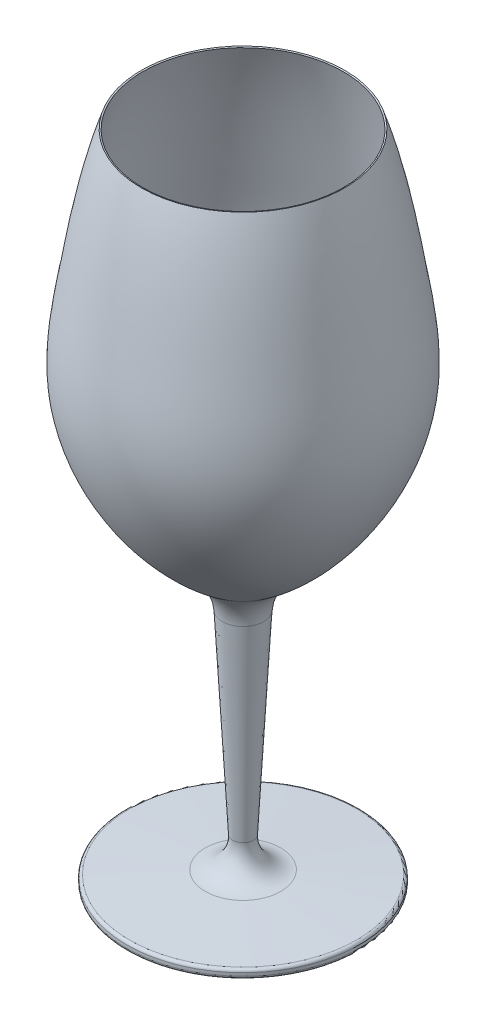
ISO-10303-21;
HEADER;
FILE_DESCRIPTION(('STEP AP214'),'2;1');
FILE_NAME('part.step','',(''),(''),'','','');
FILE_SCHEMA(('AUTOMOTIVE_DESIGN { 1 0 10303 214 1 1 1 1 }'));
ENDSEC;
DATA;
#1=APPLICATION_CONTEXT('core data for automotive mechanical design processes');
#2=APPLICATION_PROTOCOL_DEFINITION('international standard','automotive_design',2000,#1);
#3=PRODUCT_CONTEXT('',#1,'mechanical');
#4=PRODUCT('Part','Part','',(#3));
#5=PRODUCT_RELATED_PRODUCT_CATEGORY('part','',(#4));
#6=PRODUCT_DEFINITION_FORMATION('','',#4);
#7=PRODUCT_DEFINITION_CONTEXT('part definition',#1,'design');
#8=PRODUCT_DEFINITION('design','',#6,#7);
#9=PRODUCT_DEFINITION_SHAPE('','',#8);
#10=(LENGTH_UNIT() NAMED_UNIT(*) SI_UNIT(.MILLI.,.METRE.));
#11=(NAMED_UNIT(*) PLANE_ANGLE_UNIT() SI_UNIT($,.RADIAN.));
#12=(NAMED_UNIT(*) SI_UNIT($,.STERADIAN.) SOLID_ANGLE_UNIT());
#13=UNCERTAINTY_MEASURE_WITH_UNIT(LENGTH_MEASURE(1.E-05),#10,'distance_accuracy_value','');
#14=(GEOMETRIC_REPRESENTATION_CONTEXT(3) GLOBAL_UNCERTAINTY_ASSIGNED_CONTEXT((#13)) GLOBAL_UNIT_ASSIGNED_CONTEXT((#10,
#11,#12)) REPRESENTATION_CONTEXT('',''));
#15=CARTESIAN_POINT('',(0.,0.,0.));
#16=DIRECTION('',(0.,0.,1.));
#17=DIRECTION('',(1.,0.,0.));
#18=AXIS2_PLACEMENT_3D('',#15,#16,#17);
#19=CARTESIAN_POINT('',(7.5,90.5,0.));
#20=DIRECTION('',(0.,-1.,0.));
#21=DIRECTION('',(0.,0.,-1.));
#22=AXIS2_PLACEMENT_3D('',#19,#20,#21);
#23=PLANE('',#22);
#24=CARTESIAN_POINT('',(0.,90.5,0.));
#25=DIRECTION('',(0.,1.,0.));
#26=DIRECTION('',(0.,0.,1.));
#27=AXIS2_PLACEMENT_3D('',#24,#25,#26);
#28=CIRCLE('',#27,7.36580755563536);
#29=CARTESIAN_POINT('',(0.,90.5,7.36580755563536));
#30=VERTEX_POINT('',#29);
#31=EDGE_CURVE('E83',#30,#30,#28,.T.);
#32=ORIENTED_EDGE('',*,*,#31,.T.);
#33=EDGE_LOOP('',(#32));
#34=FACE_BOUND('',#33,.T.);
#35=ADVANCED_FACE('F37',(#34),#23,.F.);
#36=CARTESIAN_POINT('',(35.,225.,0.));
#37=CARTESIAN_POINT('',(39.9170201792758,210.365056176156,0.));
#38=CARTESIAN_POINT('',(44.1056743266489,185.466353245277,0.));
#39=CARTESIAN_POINT('',(52.4361400505516,135.138835851977,0.));
#40=CARTESIAN_POINT('',(28.2814009491732,101.995192324676,0.));
#41=CARTESIAN_POINT('',(7.49999999999999,90.,0.));
#42=B_SPLINE_CURVE_WITH_KNOTS('',3,(#36,#37,#38,#39,#40,#41),.UNSPECIFIED.,.F.,.F.,(4,1,1,4),
(0.,0.30696974385016,0.507280242844437,1.),.UNSPECIFIED.);
#43=CARTESIAN_POINT('',(0.,231.75,0.));
#44=DIRECTION('',(0.,1.,0.));
#45=AXIS1_PLACEMENT('',#43,#44);
#46=SURFACE_OF_REVOLUTION('',#42,#45);
#47=CARTESIAN_POINT('',(0.,94.0246612386085,0.));
#48=DIRECTION('',(0.,1.,0.));
#49=DIRECTION('',(0.,0.,1.));
#50=AXIS2_PLACEMENT_3D('',#47,#48,#49);
#51=CIRCLE('',#50,13.7404106026119);
#52=CARTESIAN_POINT('',(0.,94.0246612386085,13.7404106026119));
#53=VERTEX_POINT('',#52);
#54=EDGE_CURVE('E66',#53,#53,#51,.T.);
#55=ORIENTED_EDGE('',*,*,#54,.T.);
#56=EDGE_LOOP('',(#55));
#57=FACE_BOUND('',#56,.T.);
#58=CARTESIAN_POINT('',(0.,225.,0.));
#59=DIRECTION('',(0.,1.,0.));
#60=DIRECTION('',(0.,0.,1.));
#61=AXIS2_PLACEMENT_3D('',#58,#59,#60);
#62=CIRCLE('',#61,35.);
#63=CARTESIAN_POINT('',(0.,225.,35.));
#64=VERTEX_POINT('',#63);
#65=EDGE_CURVE('E78',#64,#64,#62,.T.);
#66=ORIENTED_EDGE('',*,*,#65,.F.);
#67=EDGE_LOOP('',(#66));
#68=FACE_BOUND('',#67,.T.);
#69=ADVANCED_FACE('F118',(#57,#68),#46,.F.);
#70=CARTESIAN_POINT('',(0.,224.840758404647,0.));
#71=DIRECTION('',(0.,1.,0.));
#72=DIRECTION('',(0.,0.,1.));
#73=AXIS2_PLACEMENT_3D('',#70,#71,#72);
#74=CONICAL_SURFACE('',#73,34.5260357457473,1.24666740101103);
#75=ORIENTED_EDGE('',*,*,#65,.T.);
#76=EDGE_LOOP('',(#75));
#77=FACE_BOUND('',#76,.T.);
#78=CARTESIAN_POINT('',(0.,224.840758404647,0.));
#79=DIRECTION('',(0.,1.,0.));
#80=DIRECTION('',(0.,0.,1.));
#81=AXIS2_PLACEMENT_3D('',#78,#79,#80);
#82=CIRCLE('',#81,34.5260357457473);
#83=CARTESIAN_POINT('',(0.,224.840758404647,34.5260357457473));
#84=VERTEX_POINT('',#83);
#85=EDGE_CURVE('E88',#84,#84,#82,.T.);
#86=ORIENTED_EDGE('',*,*,#85,.F.);
#87=EDGE_LOOP('',(#86));
#88=FACE_BOUND('',#87,.T.);
#89=ADVANCED_FACE('F112',(#77,#88),#74,.F.);
#90=CARTESIAN_POINT('',(34.5260357457473,224.840758404647,0.));
#91=CARTESIAN_POINT('',(38.5134237229265,212.972757680174,0.));
#92=CARTESIAN_POINT('',(40.9330721074188,200.804932363677,0.));
#93=CARTESIAN_POINT('',(43.6025770812448,185.350494263987,0.));
#94=CARTESIAN_POINT('',(44.1195015259819,182.246673106994,0.));
#95=CARTESIAN_POINT('',(45.1551011310871,176.021305771008,0.));
#96=CARTESIAN_POINT('',(45.6664132655203,172.903480540182,0.));
#97=CARTESIAN_POINT('',(46.9540801874856,163.5571058913,0.));
#98=CARTESIAN_POINT('',(47.483447686818,157.336251857612,0.));
#99=CARTESIAN_POINT('',(46.887857201014,148.109063780249,0.));
#100=CARTESIAN_POINT('',(46.4484540362197,145.046089868041,0.));
#101=CARTESIAN_POINT('',(45.1248415608101,138.980779569992,0.));
#102=CARTESIAN_POINT('',(44.2420199226576,135.979713915717,0.));
#103=CARTESIAN_POINT('',(40.9995332141692,127.1369328505,0.));
#104=CARTESIAN_POINT('',(38.0456792538947,121.455648509251,0.));
#105=CARTESIAN_POINT('',(27.3662952808406,105.581699817172,0.));
#106=CARTESIAN_POINT('',(17.8215249659856,96.560824876477,0.));
#107=CARTESIAN_POINT('',(7.36580755563536,90.5,0.));
#108=B_SPLINE_CURVE_WITH_KNOTS('',3,(#90,#91,#92,#93,#94,#95,#96,#97,#98,#99,#100,#101,#102,
#103,#104,#105,#106,#107),.UNSPECIFIED.,.F.,.F.,(4,2,2,2,2,2,2,2,4),(0.,0.25,0.3125,0.375,
0.500000000000001,0.562500000000001,0.625000000000001,0.750000000000001,1.),.UNSPECIFIED.);
#109=CARTESIAN_POINT('',(0.,231.75,0.));
#110=DIRECTION('',(0.,1.,0.));
#111=AXIS1_PLACEMENT('',#109,#110);
#112=SURFACE_OF_REVOLUTION('',#108,#111);
#113=ORIENTED_EDGE('',*,*,#31,.F.);
#114=EDGE_LOOP('',(#113));
#115=FACE_BOUND('',#114,.T.);
#116=ORIENTED_EDGE('',*,*,#85,.T.);
#117=EDGE_LOOP('',(#116));
#118=FACE_BOUND('',#117,.T.);
#119=ADVANCED_FACE('F107',(#115,#118),#112,.T.);
#120=CARTESIAN_POINT('',(40.,0.,0.));
#121=DIRECTION('',(0.,-1.,0.));
#122=DIRECTION('',(0.,0.,-1.));
#123=AXIS2_PLACEMENT_3D('',#120,#121,#122);
#124=PLANE('',#123);
#125=CARTESIAN_POINT('',(0.,0.,0.));
#126=DIRECTION('',(0.,-1.,0.));
#127=DIRECTION('',(0.,0.,-1.));
#128=AXIS2_PLACEMENT_3D('',#125,#126,#127);
#129=CIRCLE('',#128,39.);
#130=CARTESIAN_POINT('',(0.,0.,-39.));
#131=VERTEX_POINT('',#130);
#132=EDGE_CURVE('E46',#131,#131,#129,.T.);
#133=ORIENTED_EDGE('',*,*,#132,.T.);
#134=EDGE_LOOP('',(#133));
#135=FACE_BOUND('',#134,.T.);
#136=ADVANCED_FACE('F111',(#135),#124,.T.);
#137=CARTESIAN_POINT('',(0.,231.75,0.));
#138=DIRECTION('',(0.,1.,0.));
#139=DIRECTION('',(0.,0.,1.));
#140=AXIS2_PLACEMENT_3D('',#137,#138,#139);
#141=CYLINDRICAL_SURFACE('',#140,40.);
#142=CARTESIAN_POINT('',(0.,1.,0.));
#143=DIRECTION('',(0.,-1.,0.));
#144=DIRECTION('',(0.,0.,-1.));
#145=AXIS2_PLACEMENT_3D('',#142,#143,#144);
#146=CIRCLE('',#145,40.);
#147=CARTESIAN_POINT('',(0.,1.,-40.));
#148=VERTEX_POINT('',#147);
#149=EDGE_CURVE('E51',#148,#148,#146,.F.);
#150=ORIENTED_EDGE('',*,*,#149,.T.);
#151=EDGE_LOOP('',(#150));
#152=FACE_BOUND('',#151,.T.);
#153=CARTESIAN_POINT('',(0.,2.05259419926224,0.));
#154=DIRECTION('',(0.,-1.,0.));
#155=DIRECTION('',(0.,0.,-1.));
#156=AXIS2_PLACEMENT_3D('',#153,#154,#155);
#157=CIRCLE('',#156,40.);
#158=CARTESIAN_POINT('',(0.,2.05259419926224,-40.));
#159=VERTEX_POINT('',#158);
#160=EDGE_CURVE('E56',#159,#159,#157,.T.);
#161=ORIENTED_EDGE('',*,*,#160,.T.);
#162=EDGE_LOOP('',(#161));
#163=FACE_BOUND('',#162,.T.);
#164=ADVANCED_FACE('F149',(#152,#163),#141,.T.);
#165=CARTESIAN_POINT('',(0.,5.,0.));
#166=DIRECTION('',(0.,-1.,0.));
#167=DIRECTION('',(0.,0.,-1.));
#168=AXIS2_PLACEMENT_3D('',#165,#166,#167);
#169=CONICAL_SURFACE('',#168,3.,1.51679482641893);
#170=CARTESIAN_POINT('',(0.,3.05113647253974,0.));
#171=DIRECTION('',(0.,1.,0.));
#172=DIRECTION('',(0.,0.,1.));
#173=AXIS2_PLACEMENT_3D('',#170,#171,#172);
#174=CIRCLE('',#173,39.053975258015);
#175=CARTESIAN_POINT('',(0.,3.05113647253974,-39.053975258015));
#176=VERTEX_POINT('',#175);
#177=EDGE_CURVE('E10',#176,#176,#174,.T.);
#178=CARTESIAN_POINT('',(0.,4.46084605201327,0.));
#179=DIRECTION('',(0.,-1.,0.));
#180=DIRECTION('',(0.,0.,-1.));
#181=AXIS2_PLACEMENT_3D('',#178,#179,#180);
#182=CIRCLE('',#181,12.9743480377545);
#183=CARTESIAN_POINT('',(0.,4.46084605201327,-12.9743480377545));
#184=VERTEX_POINT('',#183);
#185=EDGE_CURVE('E70',#184,#184,#182,.T.);
#186=CARTESIAN_POINT('',(0.,3.05113647253974,-39.053975258015));
#187=CARTESIAN_POINT('',(0.,3.06582094732592,-38.7823124744706));
#188=CARTESIAN_POINT('',(0.,3.0805054221121,-38.5106496909263));
#189=CARTESIAN_POINT('',(0.,3.10987437168447,-37.9673241238375));
#190=CARTESIAN_POINT('',(0.,3.12455884647065,-37.6956613402931));
#191=CARTESIAN_POINT('',(0.,3.15392779604301,-37.1523357732043));
#192=CARTESIAN_POINT('',(0.,3.1686122708292,-36.88067298966));
#193=CARTESIAN_POINT('',(0.,3.19798122040156,-36.3373474225712));
#194=CARTESIAN_POINT('',(0.,3.21266569518775,-36.0656846390268));
#195=CARTESIAN_POINT('',(0.,3.24203464476011,-35.5223590719381));
#196=CARTESIAN_POINT('',(0.,3.25671911954629,-35.2506962883937));
#197=CARTESIAN_POINT('',(0.,3.28608806911866,-34.7073707213049));
#198=CARTESIAN_POINT('',(0.,3.30077254390484,-34.4357079377606));
#199=CARTESIAN_POINT('',(0.,3.33014149347721,-33.8923823706718));
#200=CARTESIAN_POINT('',(0.,3.34482596826339,-33.6207195871274));
#201=CARTESIAN_POINT('',(0.,3.37419491783575,-33.0773940200387));
#202=CARTESIAN_POINT('',(0.,3.38887939262194,-32.8057312364943));
#203=CARTESIAN_POINT('',(0.,3.4182483421943,-32.2624056694055));
#204=CARTESIAN_POINT('',(0.,3.43293281698049,-31.9907428858611));
#205=CARTESIAN_POINT('',(0.,3.46230176655285,-31.4474173187724));
#206=CARTESIAN_POINT('',(0.,3.47698624133903,-31.175754535228));
#207=CARTESIAN_POINT('',(0.,3.5063551909114,-30.6324289681392));
#208=CARTESIAN_POINT('',(0.,3.52103966569758,-30.3607661845949));
#209=CARTESIAN_POINT('',(0.,3.55040861526995,-29.8174406175061));
#210=CARTESIAN_POINT('',(0.,3.56509309005613,-29.5457778339617));
#211=CARTESIAN_POINT('',(0.,3.5944620396285,-29.002452266873));
#212=CARTESIAN_POINT('',(0.,3.60914651441468,-28.7307894833286));
#213=CARTESIAN_POINT('',(0.,3.63851546398704,-28.1874639162398));
#214=CARTESIAN_POINT('',(0.,3.65319993877323,-27.9158011326954));
#215=CARTESIAN_POINT('',(0.,3.68256888834559,-27.3724755656067));
#216=CARTESIAN_POINT('',(0.,3.69725336313177,-27.1008127820623));
#217=CARTESIAN_POINT('',(0.,3.72662231270414,-26.5574872149735));
#218=CARTESIAN_POINT('',(0.,3.74130678749032,-26.2858244314291));
#219=CARTESIAN_POINT('',(0.,3.77067573706269,-25.7424988643404));
#220=CARTESIAN_POINT('',(0.,3.78536021184887,-25.470836080796));
#221=CARTESIAN_POINT('',(0.,3.81472916142124,-24.9275105137073));
#222=CARTESIAN_POINT('',(0.,3.82941363620742,-24.6558477301629));
#223=CARTESIAN_POINT('',(0.,3.85878258577978,-24.1125221630741));
#224=CARTESIAN_POINT('',(0.,3.87346706056597,-23.8408593795297));
#225=CARTESIAN_POINT('',(0.,3.90283601013833,-23.297533812441));
#226=CARTESIAN_POINT('',(0.,3.91752048492451,-23.0258710288966));
#227=CARTESIAN_POINT('',(0.,3.94688943449688,-22.4825454618078));
#228=CARTESIAN_POINT('',(0.,3.96157390928306,-22.2108826782634));
#229=CARTESIAN_POINT('',(0.,3.99094285885543,-21.6675571111747));
#230=CARTESIAN_POINT('',(0.,4.00562733364161,-21.3958943276303));
#231=CARTESIAN_POINT('',(0.,4.03499628321398,-20.8525687605416));
#232=CARTESIAN_POINT('',(0.,4.04968075800016,-20.5809059769972));
#233=CARTESIAN_POINT('',(0.,4.07904970757252,-20.0375804099084));
#234=CARTESIAN_POINT('',(0.,4.09373418235871,-19.765917626364));
#235=CARTESIAN_POINT('',(0.,4.12310313193107,-19.2225920592753));
#236=CARTESIAN_POINT('',(0.,4.13778760671725,-18.9509292757309));
#237=CARTESIAN_POINT('',(0.,4.16715655628962,-18.4076037086421));
#238=CARTESIAN_POINT('',(0.,4.1818410310758,-18.1359409250978));
#239=CARTESIAN_POINT('',(0.,4.21120998064817,-17.592615358009));
#240=CARTESIAN_POINT('',(0.,4.22589445543435,-17.3209525744646));
#241=CARTESIAN_POINT('',(0.,4.25526340500672,-16.7776270073758));
#242=CARTESIAN_POINT('',(0.,4.2699478797929,-16.5059642238315));
#243=CARTESIAN_POINT('',(0.,4.29931682936526,-15.9626386567427));
#244=CARTESIAN_POINT('',(0.,4.31400130415145,-15.6909758731983));
#245=CARTESIAN_POINT('',(0.,4.34337025372381,-15.1476503061096));
#246=CARTESIAN_POINT('',(0.,4.35805472850999,-14.8759875225652));
#247=CARTESIAN_POINT('',(0.,4.38742367808236,-14.3326619554764));
#248=CARTESIAN_POINT('',(0.,4.40210815286854,-14.0609991719321));
#249=CARTESIAN_POINT('',(0.,4.43147710244091,-13.5176736048433));
#250=CARTESIAN_POINT('',(0.,4.44616157722709,-13.2460108212989));
#251=CARTESIAN_POINT('',(0.,4.46084605201327,-12.9743480377545));
#252=B_SPLINE_CURVE_WITH_KNOTS('',3,(#186,#187,#188,#189,#190,#191,#192,#193,#194,#195,#196,
#197,#198,#199,#200,#201,#202,#203,#204,#205,#206,#207,#208,#209,#210,#211,#212,#213,#214,#215,
#216,#217,#218,#219,#220,#221,#222,#223,#224,#225,#226,#227,#228,#229,#230,#231,#232,#233,#234,
#235,#236,#237,#238,#239,#240,#241,#242,#243,#244,#245,#246,#247,#248,#249,#250,#251),
.UNSPECIFIED.,.F.,.F.,(4,2,2,2,2,2,2,2,2,2,2,2,2,2,2,2,2,2,2,2,2,2,2,2,2,2,2,2,2,2,2,2,4),(0.,
0.816178115282096,1.6323562305642,2.44853434584629,3.26471246112839,4.08089057641049,
4.89706869169259,5.71324680697469,6.52942492225679,7.3456030375389,8.16178115282099,
8.97795926810309,9.79413738338519,10.6103154986673,11.4264936139494,12.2426717292315,
13.0588498445136,13.8750279597957,14.6912060750778,15.5073841903599,16.323562305642,
17.1397404209241,17.9559185362062,18.7720966514883,19.5882747667704,20.4044528820525,
21.2206309973346,22.0368091126167,22.8529872278988,23.6691653431809,24.485343458463,
25.3015215737451,26.1176996890272),.UNSPECIFIED.);
#253=EDGE_CURVE('BSEAM152',#176,#184,#252,.T.);
#254=ORIENTED_EDGE('',*,*,#177,.T.);
#255=ORIENTED_EDGE('',*,*,#185,.T.);
#256=ORIENTED_EDGE('',*,*,#253,.T.);
#257=ORIENTED_EDGE('',*,*,#253,.F.);
#258=EDGE_LOOP('',(#254,#256,#255,#257));
#259=FACE_BOUND('',#258,.T.);
#260=ADVANCED_FACE('F152',(#259),#169,.T.);
#261=CARTESIAN_POINT('',(0.,90.,0.));
#262=DIRECTION('',(0.,1.,0.));
#263=DIRECTION('',(0.,0.,1.));
#264=AXIS2_PLACEMENT_3D('',#261,#262,#263);
#265=CONICAL_SURFACE('',#264,7.49999999999999,0.05289179886572);
#266=CARTESIAN_POINT('',(0.,81.8552378264217,0.));
#267=DIRECTION('',(0.,1.,0.));
#268=DIRECTION('',(0.,0.,1.));
#269=AXIS2_PLACEMENT_3D('',#266,#267,#268);
#270=CIRCLE('',#269,7.06880670845761);
#271=CARTESIAN_POINT('',(0.,81.8552378264217,7.06880670845761));
#272=VERTEX_POINT('',#271);
#273=EDGE_CURVE('E62',#272,#272,#270,.F.);
#274=ORIENTED_EDGE('',*,*,#273,.T.);
#275=EDGE_LOOP('',(#274));
#276=FACE_BOUND('',#275,.T.);
#277=CARTESIAN_POINT('',(0.,14.9749401961898,0.));
#278=DIRECTION('',(0.,1.,0.));
#279=DIRECTION('',(0.,0.,1.));
#280=AXIS2_PLACEMENT_3D('',#277,#278,#279);
#281=CIRCLE('',#280,3.52808506921005);
#282=CARTESIAN_POINT('',(0.,14.9749401961898,3.52808506921005));
#283=VERTEX_POINT('',#282);
#284=EDGE_CURVE('E74',#283,#283,#281,.T.);
#285=ORIENTED_EDGE('',*,*,#284,.T.);
#286=EDGE_LOOP('',(#285));
#287=FACE_BOUND('',#286,.T.);
#288=ADVANCED_FACE('F135',(#276,#287),#265,.T.);
#289=CARTESIAN_POINT('',(0.,14.4462687847884,0.));
#290=DIRECTION('',(0.,1.,0.));
#291=DIRECTION('',(0.,0.,1.));
#292=AXIS2_PLACEMENT_3D('',#289,#290,#291);
#293=TOROIDAL_SURFACE('',#292,13.5141006179045,10.);
#294=ORIENTED_EDGE('',*,*,#185,.F.);
#295=EDGE_LOOP('',(#294));
#296=FACE_BOUND('',#295,.T.);
#297=ORIENTED_EDGE('',*,*,#284,.F.);
#298=EDGE_LOOP('',(#297));
#299=FACE_BOUND('',#298,.T.);
#300=ADVANCED_FACE('F131',(#296,#299),#293,.F.);
#301=CARTESIAN_POINT('',(0.,81.0093635681793,0.));
#302=DIRECTION('',(0.,1.,0.));
#303=DIRECTION('',(0.,0.,1.));
#304=AXIS2_PLACEMENT_3D('',#301,#302,#303);
#305=TOROIDAL_SURFACE('',#304,23.0464315863687,16.);
#306=ORIENTED_EDGE('',*,*,#273,.F.);
#307=EDGE_LOOP('',(#306));
#308=FACE_BOUND('',#307,.T.);
#309=ORIENTED_EDGE('',*,*,#54,.F.);
#310=EDGE_LOOP('',(#309));
#311=FACE_BOUND('',#310,.T.);
#312=ADVANCED_FACE('F134',(#308,#311),#305,.F.);
#313=CARTESIAN_POINT('',(0.,1.,0.));
#314=DIRECTION('',(0.,-1.,0.));
#315=DIRECTION('',(0.,0.,-1.));
#316=AXIS2_PLACEMENT_3D('',#313,#314,#315);
#317=TOROIDAL_SURFACE('',#316,39.,1.);
#318=ORIENTED_EDGE('',*,*,#132,.F.);
#319=EDGE_LOOP('',(#318));
#320=FACE_BOUND('',#319,.T.);
#321=ORIENTED_EDGE('',*,*,#149,.F.);
#322=EDGE_LOOP('',(#321));
#323=FACE_BOUND('',#322,.T.);
#324=ADVANCED_FACE('F138',(#320,#323),#317,.T.);
#325=CARTESIAN_POINT('',(0.,2.05259419926224,0.));
#326=DIRECTION('',(0.,-1.,0.));
#327=DIRECTION('',(0.,0.,-1.));
#328=AXIS2_PLACEMENT_3D('',#325,#326,#327);
#329=TOROIDAL_SURFACE('',#328,39.,1.);
#330=ORIENTED_EDGE('',*,*,#160,.F.);
#331=EDGE_LOOP('',(#330));
#332=FACE_BOUND('',#331,.T.);
#333=ORIENTED_EDGE('',*,*,#177,.F.);
#334=EDGE_LOOP('',(#333));
#335=FACE_BOUND('',#334,.T.);
#336=ADVANCED_FACE('F39',(#332,#335),#329,.T.);
#337=CLOSED_SHELL('',(#35,#69,#89,#119,#136,#164,#260,#288,#300,#312,#324,#336));
#338=CARTESIAN_POINT('',(7.5,90.,0.));
#339=DIRECTION('',(0.,-1.,0.));
#340=DIRECTION('',(0.,0.,-1.));
#341=AXIS2_PLACEMENT_3D('',#338,#339,#340);
#342=PLANE('',#341);
#343=CARTESIAN_POINT('',(0.,90.,0.));
#344=DIRECTION('',(0.,-1.,0.));
#345=DIRECTION('',(0.,0.,-1.));
#346=AXIS2_PLACEMENT_3D('',#343,#344,#345);
#347=CIRCLE('',#346,6.99929979824098);
#348=CARTESIAN_POINT('',(0.,90.,-6.99929979824098));
#349=VERTEX_POINT('',#348);
#350=EDGE_CURVE('E79',#349,#349,#347,.T.);
#351=ORIENTED_EDGE('',*,*,#350,.T.);
#352=EDGE_LOOP('',(#351));
#353=FACE_BOUND('',#352,.T.);
#354=CARTESIAN_POINT('',(0.,90.,0.));
#355=DIRECTION('',(0.,1.,0.));
#356=DIRECTION('',(0.,0.,1.));
#357=AXIS2_PLACEMENT_3D('',#354,#355,#356);
#358=CIRCLE('',#357,0.5);
#359=CARTESIAN_POINT('',(0.,90.,0.5));
#360=VERTEX_POINT('',#359);
#361=EDGE_CURVE('E202',#360,#360,#358,.T.);
#362=ORIENTED_EDGE('',*,*,#361,.T.);
#363=EDGE_LOOP('',(#362));
#364=FACE_BOUND('',#363,.T.);
#365=ADVANCED_FACE('F123',(#353,#364),#342,.T.);
#366=CARTESIAN_POINT('',(0.,231.75,0.));
#367=DIRECTION('',(0.,1.,0.));
#368=DIRECTION('',(0.,0.,1.));
#369=AXIS2_PLACEMENT_3D('',#366,#367,#368);
#370=CYLINDRICAL_SURFACE('',#369,0.5);
#371=ORIENTED_EDGE('',*,*,#361,.F.);
#372=EDGE_LOOP('',(#371));
#373=FACE_BOUND('',#372,.T.);
#374=CARTESIAN_POINT('',(0.,0.5,0.));
#375=DIRECTION('',(0.,1.,0.));
#376=DIRECTION('',(0.,0.,1.));
#377=AXIS2_PLACEMENT_3D('',#374,#375,#376);
#378=CIRCLE('',#377,0.5);
#379=CARTESIAN_POINT('',(0.,0.5,0.5));
#380=VERTEX_POINT('',#379);
#381=EDGE_CURVE('E84',#380,#380,#378,.T.);
#382=ORIENTED_EDGE('',*,*,#381,.T.);
#383=EDGE_LOOP('',(#382));
#384=FACE_BOUND('',#383,.T.);
#385=ADVANCED_FACE('F114',(#373,#384),#370,.T.);
#386=CARTESIAN_POINT('',(40.,0.5,0.));
#387=DIRECTION('',(0.,-1.,0.));
#388=DIRECTION('',(0.,0.,-1.));
#389=AXIS2_PLACEMENT_3D('',#386,#387,#388);
#390=PLANE('',#389);
#391=ORIENTED_EDGE('',*,*,#381,.F.);
#392=EDGE_LOOP('',(#391));
#393=FACE_BOUND('',#392,.T.);
#394=CARTESIAN_POINT('',(0.,0.5,0.));
#395=DIRECTION('',(0.,1.,0.));
#396=DIRECTION('',(0.,0.,1.));
#397=AXIS2_PLACEMENT_3D('',#394,#395,#396);
#398=CIRCLE('',#397,39.5);
#399=CARTESIAN_POINT('',(0.,0.5,39.5));
#400=VERTEX_POINT('',#399);
#401=EDGE_CURVE('E189',#400,#400,#398,.T.);
#402=ORIENTED_EDGE('',*,*,#401,.T.);
#403=EDGE_LOOP('',(#402));
#404=FACE_BOUND('',#403,.T.);
#405=ADVANCED_FACE('F176',(#393,#404),#390,.F.);
#406=CARTESIAN_POINT('',(0.,231.75,0.));
#407=DIRECTION('',(0.,1.,0.));
#408=DIRECTION('',(0.,0.,1.));
#409=AXIS2_PLACEMENT_3D('',#406,#407,#408);
#410=CYLINDRICAL_SURFACE('',#409,39.5);
#411=ORIENTED_EDGE('',*,*,#401,.F.);
#412=EDGE_LOOP('',(#411));
#413=FACE_BOUND('',#412,.T.);
#414=CARTESIAN_POINT('',(0.,2.52629709963112,0.));
#415=DIRECTION('',(0.,1.,0.));
#416=DIRECTION('',(0.,0.,1.));
#417=AXIS2_PLACEMENT_3D('',#414,#415,#416);
#418=CIRCLE('',#417,39.5);
#419=CARTESIAN_POINT('',(0.,2.52629709963112,-39.5));
#420=VERTEX_POINT('',#419);
#421=EDGE_CURVE('E191',#420,#420,#418,.T.);
#422=ORIENTED_EDGE('',*,*,#421,.T.);
#423=EDGE_LOOP('',(#422));
#424=FACE_BOUND('',#423,.T.);
#425=ADVANCED_FACE('F173',(#413,#424),#410,.F.);
#426=CARTESIAN_POINT('',(0.,4.52768656076061,0.));
#427=DIRECTION('',(0.,-1.,0.));
#428=DIRECTION('',(0.,0.,-1.));
#429=AXIS2_PLACEMENT_3D('',#426,#427,#428);
#430=CONICAL_SURFACE('',#429,2.47429496910478,1.51679482641893);
#431=CARTESIAN_POINT('',(0.,4.52768656076061,0.));
#432=DIRECTION('',(0.,1.,0.));
#433=DIRECTION('',(0.,0.,1.));
#434=AXIS2_PLACEMENT_3D('',#431,#432,#433);
#435=CIRCLE('',#434,2.47429496910478);
#436=CARTESIAN_POINT('',(0.,4.52768656076061,-2.47429496910478));
#437=VERTEX_POINT('',#436);
#438=EDGE_CURVE('E196',#437,#437,#435,.T.);
#439=CARTESIAN_POINT('',(0.,2.52629709963112,-39.5));
#440=CARTESIAN_POINT('',(0.,2.54714490651789,-39.1143155725949));
#441=CARTESIAN_POINT('',(0.,2.56799271340465,-38.7286311451897));
#442=CARTESIAN_POINT('',(0.,2.60968832717818,-37.9572622903794));
#443=CARTESIAN_POINT('',(0.,2.63053613406495,-37.5715778629742));
#444=CARTESIAN_POINT('',(0.,2.67223174783848,-36.8002090081639));
#445=CARTESIAN_POINT('',(0.,2.69307955472524,-36.4145245807588));
#446=CARTESIAN_POINT('',(0.,2.73477516849877,-35.6431557259484));
#447=CARTESIAN_POINT('',(0.,2.75562297538554,-35.2574712985433));
#448=CARTESIAN_POINT('',(0.,2.79731858915907,-34.486102443733));
#449=CARTESIAN_POINT('',(0.,2.81816639604584,-34.1004180163278));
#450=CARTESIAN_POINT('',(0.,2.85986200981937,-33.3290491615175));
#451=CARTESIAN_POINT('',(0.,2.88070981670613,-32.9433647341123));
#452=CARTESIAN_POINT('',(0.,2.92240543047966,-32.171995879302));
#453=CARTESIAN_POINT('',(0.,2.94325323736643,-31.7863114518969));
#454=CARTESIAN_POINT('',(0.,2.98494885113996,-31.0149425970865));
#455=CARTESIAN_POINT('',(0.,3.00579665802673,-30.6292581696814));
#456=CARTESIAN_POINT('',(0.,3.04749227180026,-29.8578893148711));
#457=CARTESIAN_POINT('',(0.,3.06834007868702,-29.4722048874659));
#458=CARTESIAN_POINT('',(0.,3.11003569246055,-28.7008360326556));
#459=CARTESIAN_POINT('',(0.,3.13088349934732,-28.3151516052504));
#460=CARTESIAN_POINT('',(0.,3.17257911312085,-27.5437827504401));
#461=CARTESIAN_POINT('',(0.,3.19342692000762,-27.1580983230349));
#462=CARTESIAN_POINT('',(0.,3.23512253378115,-26.3867294682246));
#463=CARTESIAN_POINT('',(0.,3.25597034066791,-26.0010450408195));
#464=CARTESIAN_POINT('',(0.,3.29766595444144,-25.2296761860092));
#465=CARTESIAN_POINT('',(0.,3.31851376132821,-24.843991758604));
#466=CARTESIAN_POINT('',(0.,3.36020937510174,-24.0726229037937));
#467=CARTESIAN_POINT('',(0.,3.38105718198851,-23.6869384763885));
#468=CARTESIAN_POINT('',(0.,3.42275279576204,-22.9155696215782));
#469=CARTESIAN_POINT('',(0.,3.4436006026488,-22.529885194173));
#470=CARTESIAN_POINT('',(0.,3.48529621642233,-21.7585163393627));
#471=CARTESIAN_POINT('',(0.,3.5061440233091,-21.3728319119576));
#472=CARTESIAN_POINT('',(0.,3.54783963708263,-20.6014630571473));
#473=CARTESIAN_POINT('',(0.,3.56868744396939,-20.2157786297421));
#474=CARTESIAN_POINT('',(0.,3.61038305774293,-19.4444097749318));
#475=CARTESIAN_POINT('',(0.,3.63123086462969,-19.0587253475266));
#476=CARTESIAN_POINT('',(0.,3.67292647840322,-18.2873564927163));
#477=CARTESIAN_POINT('',(0.,3.69377428528999,-17.9016720653111));
#478=CARTESIAN_POINT('',(0.,3.73546989906352,-17.1303032105008));
#479=CARTESIAN_POINT('',(0.,3.75631770595028,-16.7446187830957));
#480=CARTESIAN_POINT('',(0.,3.79801331972382,-15.9732499282853));
#481=CARTESIAN_POINT('',(0.,3.81886112661058,-15.5875655008802));
#482=CARTESIAN_POINT('',(0.,3.86055674038411,-14.8161966460699));
#483=CARTESIAN_POINT('',(0.,3.88140454727088,-14.4305122186647));
#484=CARTESIAN_POINT('',(0.,3.92310016104441,-13.6591433638544));
#485=CARTESIAN_POINT('',(0.,3.94394796793117,-13.2734589364492));
#486=CARTESIAN_POINT('',(0.,3.9856435817047,-12.5020900816389));
#487=CARTESIAN_POINT('',(0.,4.00649138859147,-12.1164056542338));
#488=CARTESIAN_POINT('',(0.,4.048187002365,-11.3450367994234));
#489=CARTESIAN_POINT('',(0.,4.06903480925177,-10.9593523720183));
#490=CARTESIAN_POINT('',(0.,4.1107304230253,-10.187983517208));
#491=CARTESIAN_POINT('',(0.,4.13157822991206,-9.8022990898028));
#492=CARTESIAN_POINT('',(0.,4.17327384368559,-9.03093023499249));
#493=CARTESIAN_POINT('',(0.,4.19412165057236,-8.64524580758733));
#494=CARTESIAN_POINT('',(0.,4.23581726434589,-7.87387695277701));
#495=CARTESIAN_POINT('',(0.,4.25666507123266,-7.48819252537185));
#496=CARTESIAN_POINT('',(0.,4.29836068500619,-6.71682367056153));
#497=CARTESIAN_POINT('',(0.,4.31920849189295,-6.33113924315637));
#498=CARTESIAN_POINT('',(0.,4.36090410566648,-5.55977038834606));
#499=CARTESIAN_POINT('',(0.,4.38175191255325,-5.1740859609409));
#500=CARTESIAN_POINT('',(0.,4.42344752632678,-4.40271710613058));
#501=CARTESIAN_POINT('',(0.,4.44429533321355,-4.01703267872542));
#502=CARTESIAN_POINT('',(0.,4.48599094698708,-3.2456638239151));
#503=CARTESIAN_POINT('',(0.,4.50683875387384,-2.85997939650994));
#504=CARTESIAN_POINT('',(0.,4.52768656076061,-2.47429496910478));
#505=B_SPLINE_CURVE_WITH_KNOTS('',3,(#439,#440,#441,#442,#443,#444,#445,#446,#447,#448,#449,
#450,#451,#452,#453,#454,#455,#456,#457,#458,#459,#460,#461,#462,#463,#464,#465,#466,#467,#468,
#469,#470,#471,#472,#473,#474,#475,#476,#477,#478,#479,#480,#481,#482,#483,#484,#485,#486,#487,
#488,#489,#490,#491,#492,#493,#494,#495,#496,#497,#498,#499,#500,#501,#502,#503,#504),
.UNSPECIFIED.,.F.,.F.,(4,2,2,2,2,2,2,2,2,2,2,2,2,2,2,2,2,2,2,2,2,2,2,2,2,2,2,2,2,2,2,2,4),(0.,
1.15874241199393,2.31748482398785,3.47622723598177,4.6349696479757,5.79371205996962,
6.95245447196355,8.11119688395748,9.2699392959514,10.4286817079453,11.5874241199392,
12.7461665319332,13.9049089439271,15.063651355921,16.2223937679149,17.3811361799089,
18.5398785919028,19.6986210038967,20.8573634158906,22.0161058278846,23.1748482398785,
24.3335906518724,25.4923330638663,26.6510754758603,27.8098178878542,28.9685602998481,
30.127302711842,31.286045123836,32.4447875358299,33.6035299478238,34.7622723598177,
35.9210147718116,37.0797571838056),.UNSPECIFIED.);
#506=EDGE_CURVE('BSEAM169',#420,#437,#505,.T.);
#507=ORIENTED_EDGE('',*,*,#421,.F.);
#508=ORIENTED_EDGE('',*,*,#438,.T.);
#509=ORIENTED_EDGE('',*,*,#506,.T.);
#510=ORIENTED_EDGE('',*,*,#506,.F.);
#511=EDGE_LOOP('',(#507,#509,#508,#510));
#512=FACE_BOUND('',#511,.T.);
#513=ADVANCED_FACE('F169',(#512),#430,.F.);
#514=CARTESIAN_POINT('',(0.,90.02643357057,0.));
#515=DIRECTION('',(0.,1.,0.));
#516=DIRECTION('',(0.,0.,1.));
#517=AXIS2_PLACEMENT_3D('',#514,#515,#516);
#518=CONICAL_SURFACE('',#517,7.00069922256527,0.05289179886572);
#519=ORIENTED_EDGE('',*,*,#350,.F.);
#520=EDGE_LOOP('',(#519));
#521=FACE_BOUND('',#520,.T.);
#522=ORIENTED_EDGE('',*,*,#438,.F.);
#523=EDGE_LOOP('',(#522));
#524=FACE_BOUND('',#523,.T.);
#525=ADVANCED_FACE('F166',(#521,#524),#518,.F.);
#526=CLOSED_SHELL('',(#365,#385,#405,#425,#513,#525));
#527=ORIENTED_CLOSED_SHELL('',*,#526,.T.);
#528=BREP_WITH_VOIDS('B2',#337,(#527));
#529=ADVANCED_BREP_SHAPE_REPRESENTATION('',(#18,#528),#14);
#530=SHAPE_DEFINITION_REPRESENTATION(#9,#529);
ENDSEC;
END-ISO-10303-21;
